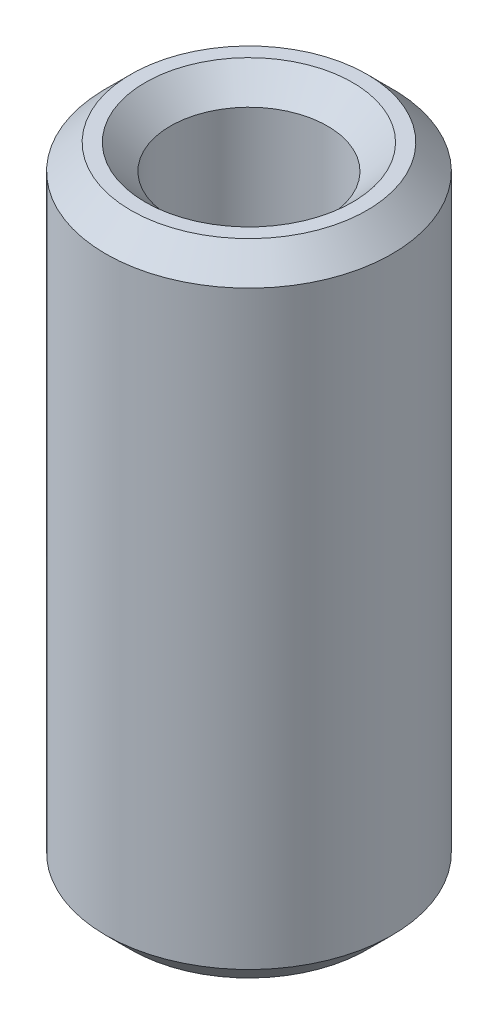
ISO-10303-21;
HEADER;
FILE_DESCRIPTION(('STEP AP214'),'2;1');
FILE_NAME('part.step','',(''),(''),'','','');
FILE_SCHEMA(('AUTOMOTIVE_DESIGN { 1 0 10303 214 1 1 1 1 }'));
ENDSEC;
DATA;
#1=APPLICATION_CONTEXT('core data for automotive mechanical design processes');
#2=APPLICATION_PROTOCOL_DEFINITION('international standard','automotive_design',2000,#1);
#3=PRODUCT_CONTEXT('',#1,'mechanical');
#4=PRODUCT('Part','Part','',(#3));
#5=PRODUCT_RELATED_PRODUCT_CATEGORY('part','',(#4));
#6=PRODUCT_DEFINITION_FORMATION('','',#4);
#7=PRODUCT_DEFINITION_CONTEXT('part definition',#1,'design');
#8=PRODUCT_DEFINITION('design','',#6,#7);
#9=PRODUCT_DEFINITION_SHAPE('','',#8);
#10=(LENGTH_UNIT() NAMED_UNIT(*) SI_UNIT(.MILLI.,.METRE.));
#11=(NAMED_UNIT(*) PLANE_ANGLE_UNIT() SI_UNIT($,.RADIAN.));
#12=(NAMED_UNIT(*) SI_UNIT($,.STERADIAN.) SOLID_ANGLE_UNIT());
#13=UNCERTAINTY_MEASURE_WITH_UNIT(LENGTH_MEASURE(1.E-05),#10,'distance_accuracy_value','');
#14=(GEOMETRIC_REPRESENTATION_CONTEXT(3) GLOBAL_UNCERTAINTY_ASSIGNED_CONTEXT((#13)) GLOBAL_UNIT_ASSIGNED_CONTEXT((#10,
#11,#12)) REPRESENTATION_CONTEXT('',''));
#15=CARTESIAN_POINT('',(0.,0.,0.));
#16=DIRECTION('',(0.,0.,1.));
#17=DIRECTION('',(1.,0.,0.));
#18=AXIS2_PLACEMENT_3D('',#15,#16,#17);
#19=CARTESIAN_POINT('',(0.,100.664642713986,0.));
#20=DIRECTION('',(0.,-1.,0.));
#21=DIRECTION('',(0.,0.,-1.));
#22=AXIS2_PLACEMENT_3D('',#19,#20,#21);
#23=CYLINDRICAL_SURFACE('',#22,22.5);
#24=CARTESIAN_POINT('',(0.,3.95173669495373,0.));
#25=DIRECTION('',(0.,1.,0.));
#26=DIRECTION('',(0.,0.,1.));
#27=AXIS2_PLACEMENT_3D('',#24,#25,#26);
#28=CIRCLE('',#27,22.5);
#29=CARTESIAN_POINT('',(0.,3.95173669495373,22.5));
#30=VERTEX_POINT('',#29);
#31=EDGE_CURVE('E10',#30,#30,#28,.T.);
#32=ORIENTED_EDGE('',*,*,#31,.T.);
#33=EDGE_LOOP('',(#32));
#34=FACE_BOUND('',#33,.T.);
#35=CARTESIAN_POINT('',(0.,96.7129060190319,0.));
#36=DIRECTION('',(0.,1.,0.));
#37=DIRECTION('',(0.,0.,1.));
#38=AXIS2_PLACEMENT_3D('',#35,#36,#37);
#39=CIRCLE('',#38,22.5);
#40=CARTESIAN_POINT('',(0.,96.7129060190319,22.5));
#41=VERTEX_POINT('',#40);
#42=EDGE_CURVE('E50',#41,#41,#39,.F.);
#43=ORIENTED_EDGE('',*,*,#42,.T.);
#44=EDGE_LOOP('',(#43));
#45=FACE_BOUND('',#44,.T.);
#46=ADVANCED_FACE('F39',(#34,#45),#23,.T.);
#47=CARTESIAN_POINT('',(0.,100.664642713986,0.));
#48=DIRECTION('',(0.,1.,0.));
#49=DIRECTION('',(0.,0.,1.));
#50=AXIS2_PLACEMENT_3D('',#47,#48,#49);
#51=PLANE('',#50);
#52=CARTESIAN_POINT('',(0.,100.664642713986,0.));
#53=DIRECTION('',(0.,1.,0.));
#54=DIRECTION('',(0.,0.,1.));
#55=AXIS2_PLACEMENT_3D('',#52,#53,#54);
#56=CIRCLE('',#55,16.3002909355662);
#57=CARTESIAN_POINT('',(0.,100.664642713986,16.3002909355662));
#58=VERTEX_POINT('',#57);
#59=EDGE_CURVE('E58',#58,#58,#56,.F.);
#60=ORIENTED_EDGE('',*,*,#59,.T.);
#61=EDGE_LOOP('',(#60));
#62=FACE_BOUND('',#61,.T.);
#63=CARTESIAN_POINT('',(0.,100.664642713986,0.));
#64=DIRECTION('',(0.,1.,0.));
#65=DIRECTION('',(0.,0.,1.));
#66=AXIS2_PLACEMENT_3D('',#63,#64,#65);
#67=CIRCLE('',#66,18.5482633050463);
#68=CARTESIAN_POINT('',(0.,100.664642713986,18.5482633050463));
#69=VERTEX_POINT('',#68);
#70=EDGE_CURVE('E61',#69,#69,#67,.T.);
#71=ORIENTED_EDGE('',*,*,#70,.T.);
#72=EDGE_LOOP('',(#71));
#73=FACE_BOUND('',#72,.T.);
#74=ADVANCED_FACE('F88',(#62,#73),#51,.T.);
#75=CARTESIAN_POINT('',(0.,0.,0.));
#76=DIRECTION('',(0.,1.,0.));
#77=DIRECTION('',(0.,0.,1.));
#78=AXIS2_PLACEMENT_3D('',#75,#76,#77);
#79=PLANE('',#78);
#80=CARTESIAN_POINT('',(0.,0.,0.));
#81=DIRECTION('',(0.,1.,0.));
#82=DIRECTION('',(0.,0.,1.));
#83=AXIS2_PLACEMENT_3D('',#80,#81,#82);
#84=CIRCLE('',#83,16.3002909355662);
#85=CARTESIAN_POINT('',(0.,0.,16.3002909355662));
#86=VERTEX_POINT('',#85);
#87=EDGE_CURVE('E51',#86,#86,#84,.T.);
#88=ORIENTED_EDGE('',*,*,#87,.T.);
#89=EDGE_LOOP('',(#88));
#90=FACE_BOUND('',#89,.T.);
#91=CARTESIAN_POINT('',(0.,0.,0.));
#92=DIRECTION('',(0.,1.,0.));
#93=DIRECTION('',(0.,0.,1.));
#94=AXIS2_PLACEMENT_3D('',#91,#92,#93);
#95=CIRCLE('',#94,18.5482633050462);
#96=CARTESIAN_POINT('',(0.,0.,18.5482633050462));
#97=VERTEX_POINT('',#96);
#98=EDGE_CURVE('E54',#97,#97,#95,.F.);
#99=ORIENTED_EDGE('',*,*,#98,.T.);
#100=EDGE_LOOP('',(#99));
#101=FACE_BOUND('',#100,.T.);
#102=ADVANCED_FACE('F83',(#90,#101),#79,.F.);
#103=CARTESIAN_POINT('',(0.,100.664642713986,0.));
#104=DIRECTION('',(0.,-1.,0.));
#105=DIRECTION('',(0.,0.,-1.));
#106=AXIS2_PLACEMENT_3D('',#103,#104,#105);
#107=CYLINDRICAL_SURFACE('',#106,12.3485542406125);
#108=CARTESIAN_POINT('',(0.,96.7129060190319,0.));
#109=DIRECTION('',(0.,1.,0.));
#110=DIRECTION('',(0.,0.,1.));
#111=AXIS2_PLACEMENT_3D('',#108,#109,#110);
#112=CIRCLE('',#111,12.3485542406125);
#113=CARTESIAN_POINT('',(0.,96.7129060190319,12.3485542406125));
#114=VERTEX_POINT('',#113);
#115=EDGE_CURVE('E67',#114,#114,#112,.T.);
#116=ORIENTED_EDGE('',*,*,#115,.T.);
#117=EDGE_LOOP('',(#116));
#118=FACE_BOUND('',#117,.T.);
#119=CARTESIAN_POINT('',(0.,3.95173669495374,0.));
#120=DIRECTION('',(0.,1.,0.));
#121=DIRECTION('',(0.,0.,1.));
#122=AXIS2_PLACEMENT_3D('',#119,#120,#121);
#123=CIRCLE('',#122,12.3485542406125);
#124=CARTESIAN_POINT('',(0.,3.95173669495374,12.3485542406125));
#125=VERTEX_POINT('',#124);
#126=EDGE_CURVE('E69',#125,#125,#123,.F.);
#127=ORIENTED_EDGE('',*,*,#126,.T.);
#128=EDGE_LOOP('',(#127));
#129=FACE_BOUND('',#128,.T.);
#130=ADVANCED_FACE('F71',(#118,#129),#107,.F.);
#131=CARTESIAN_POINT('',(0.,96.7129060190319,0.));
#132=DIRECTION('',(0.,1.,0.));
#133=DIRECTION('',(0.,0.,1.));
#134=AXIS2_PLACEMENT_3D('',#131,#132,#133);
#135=CONICAL_SURFACE('',#134,12.3485542406125,0.785398163397452);
#136=ORIENTED_EDGE('',*,*,#59,.F.);
#137=EDGE_LOOP('',(#136));
#138=FACE_BOUND('',#137,.T.);
#139=ORIENTED_EDGE('',*,*,#115,.F.);
#140=EDGE_LOOP('',(#139));
#141=FACE_BOUND('',#140,.T.);
#142=ADVANCED_FACE('F77',(#138,#141),#135,.F.);
#143=CARTESIAN_POINT('',(0.,0.,0.));
#144=DIRECTION('',(0.,-1.,0.));
#145=DIRECTION('',(0.,0.,-1.));
#146=AXIS2_PLACEMENT_3D('',#143,#144,#145);
#147=CONICAL_SURFACE('',#146,16.3002909355662,0.785398163397445);
#148=ORIENTED_EDGE('',*,*,#126,.F.);
#149=EDGE_LOOP('',(#148));
#150=FACE_BOUND('',#149,.T.);
#151=ORIENTED_EDGE('',*,*,#87,.F.);
#152=EDGE_LOOP('',(#151));
#153=FACE_BOUND('',#152,.T.);
#154=ADVANCED_FACE('F73',(#150,#153),#147,.F.);
#155=CARTESIAN_POINT('',(0.,3.95173669495373,0.));
#156=DIRECTION('',(0.,1.,0.));
#157=DIRECTION('',(0.,0.,1.));
#158=AXIS2_PLACEMENT_3D('',#155,#156,#157);
#159=CONICAL_SURFACE('',#158,22.5,0.785398163397452);
#160=ORIENTED_EDGE('',*,*,#98,.F.);
#161=EDGE_LOOP('',(#160));
#162=FACE_BOUND('',#161,.T.);
#163=ORIENTED_EDGE('',*,*,#31,.F.);
#164=EDGE_LOOP('',(#163));
#165=FACE_BOUND('',#164,.T.);
#166=ADVANCED_FACE('F76',(#162,#165),#159,.T.);
#167=CARTESIAN_POINT('',(0.,100.664642713986,0.));
#168=DIRECTION('',(0.,-1.,0.));
#169=DIRECTION('',(0.,0.,-1.));
#170=AXIS2_PLACEMENT_3D('',#167,#168,#169);
#171=CONICAL_SURFACE('',#170,18.5482633050463,0.785398163397444);
#172=ORIENTED_EDGE('',*,*,#42,.F.);
#173=EDGE_LOOP('',(#172));
#174=FACE_BOUND('',#173,.T.);
#175=ORIENTED_EDGE('',*,*,#70,.F.);
#176=EDGE_LOOP('',(#175));
#177=FACE_BOUND('',#176,.T.);
#178=ADVANCED_FACE('F45',(#174,#177),#171,.T.);
#179=CLOSED_SHELL('',(#46,#74,#102,#130,#142,#154,#166,#178));
#180=MANIFOLD_SOLID_BREP('B2',#179);
#181=ADVANCED_BREP_SHAPE_REPRESENTATION('',(#18,#180),#14);
#182=SHAPE_DEFINITION_REPRESENTATION(#9,#181);
ENDSEC;
END-ISO-10303-21;
